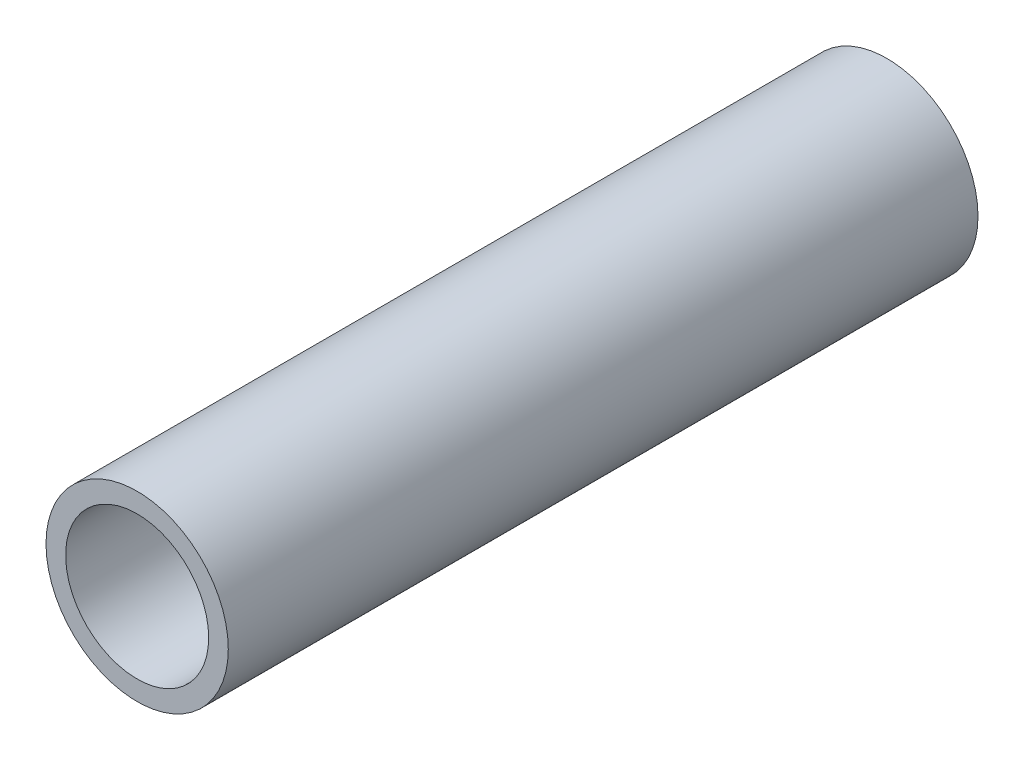
ISO-10303-21;
HEADER;
FILE_DESCRIPTION(('STEP AP214'),'2;1');
FILE_NAME('part.step','',(''),(''),'','','');
FILE_SCHEMA(('AUTOMOTIVE_DESIGN { 1 0 10303 214 1 1 1 1 }'));
ENDSEC;
DATA;
#1=APPLICATION_CONTEXT('core data for automotive mechanical design processes');
#2=APPLICATION_PROTOCOL_DEFINITION('international standard','automotive_design',2000,#1);
#3=PRODUCT_CONTEXT('',#1,'mechanical');
#4=PRODUCT('Part','Part','',(#3));
#5=PRODUCT_RELATED_PRODUCT_CATEGORY('part','',(#4));
#6=PRODUCT_DEFINITION_FORMATION('','',#4);
#7=PRODUCT_DEFINITION_CONTEXT('part definition',#1,'design');
#8=PRODUCT_DEFINITION('design','',#6,#7);
#9=PRODUCT_DEFINITION_SHAPE('','',#8);
#10=(LENGTH_UNIT() NAMED_UNIT(*) SI_UNIT(.MILLI.,.METRE.));
#11=(NAMED_UNIT(*) PLANE_ANGLE_UNIT() SI_UNIT($,.RADIAN.));
#12=(NAMED_UNIT(*) SI_UNIT($,.STERADIAN.) SOLID_ANGLE_UNIT());
#13=UNCERTAINTY_MEASURE_WITH_UNIT(LENGTH_MEASURE(1.E-05),#10,'distance_accuracy_value','');
#14=(GEOMETRIC_REPRESENTATION_CONTEXT(3) GLOBAL_UNCERTAINTY_ASSIGNED_CONTEXT((#13)) GLOBAL_UNIT_ASSIGNED_CONTEXT((#10,
#11,#12)) REPRESENTATION_CONTEXT('',''));
#15=CARTESIAN_POINT('',(0.,0.,0.));
#16=DIRECTION('',(0.,0.,1.));
#17=DIRECTION('',(1.,0.,0.));
#18=AXIS2_PLACEMENT_3D('',#15,#16,#17);
#19=CARTESIAN_POINT('',(0.,0.,762.));
#20=DIRECTION('',(0.,0.,-1.));
#21=DIRECTION('',(-1.,0.,0.));
#22=AXIS2_PLACEMENT_3D('',#19,#20,#21);
#23=CYLINDRICAL_SURFACE('',#22,13.335);
#24=CARTESIAN_POINT('',(0.,0.,-762.));
#25=DIRECTION('',(0.,0.,1.));
#26=DIRECTION('',(1.,0.,0.));
#27=AXIS2_PLACEMENT_3D('',#24,#25,#26);
#28=CIRCLE('',#27,13.335);
#29=CARTESIAN_POINT('',(13.335,0.,-762.));
#30=VERTEX_POINT('',#29);
#31=EDGE_CURVE('E11',#30,#30,#28,.T.);
#32=ORIENTED_EDGE('',*,*,#31,.T.);
#33=EDGE_LOOP('',(#32));
#34=FACE_BOUND('',#33,.T.);
#35=CARTESIAN_POINT('',(0.,0.,-652.311));
#36=DIRECTION('',(0.,0.,1.));
#37=DIRECTION('',(1.,0.,0.));
#38=AXIS2_PLACEMENT_3D('',#35,#36,#37);
#39=CIRCLE('',#38,13.335);
#40=CARTESIAN_POINT('',(13.335,0.,-652.311));
#41=VERTEX_POINT('',#40);
#42=EDGE_CURVE('E58',#41,#41,#39,.F.);
#43=ORIENTED_EDGE('',*,*,#42,.T.);
#44=EDGE_LOOP('',(#43));
#45=FACE_BOUND('',#44,.T.);
#46=ADVANCED_FACE('F43',(#34,#45),#23,.T.);
#47=CARTESIAN_POINT('',(0.,0.,762.));
#48=DIRECTION('',(0.,0.,-1.));
#49=DIRECTION('',(-1.,0.,0.));
#50=AXIS2_PLACEMENT_3D('',#47,#48,#49);
#51=CYLINDRICAL_SURFACE('',#50,10.4648);
#52=CARTESIAN_POINT('',(0.,0.,-762.));
#53=DIRECTION('',(0.,0.,1.));
#54=DIRECTION('',(1.,0.,0.));
#55=AXIS2_PLACEMENT_3D('',#52,#53,#54);
#56=CIRCLE('',#55,10.4648);
#57=CARTESIAN_POINT('',(10.4648,0.,-762.));
#58=VERTEX_POINT('',#57);
#59=EDGE_CURVE('E51',#58,#58,#56,.T.);
#60=ORIENTED_EDGE('',*,*,#59,.F.);
#61=EDGE_LOOP('',(#60));
#62=FACE_BOUND('',#61,.T.);
#63=CARTESIAN_POINT('',(0.,0.,-652.311));
#64=DIRECTION('',(0.,0.,1.));
#65=DIRECTION('',(1.,0.,0.));
#66=AXIS2_PLACEMENT_3D('',#63,#64,#65);
#67=CIRCLE('',#66,10.4648);
#68=CARTESIAN_POINT('',(10.4648,0.,-652.311));
#69=VERTEX_POINT('',#68);
#70=EDGE_CURVE('E46',#69,#69,#67,.T.);
#71=ORIENTED_EDGE('',*,*,#70,.T.);
#72=EDGE_LOOP('',(#71));
#73=FACE_BOUND('',#72,.T.);
#74=ADVANCED_FACE('F67',(#62,#73),#51,.F.);
#75=CARTESIAN_POINT('',(0.,0.,-762.));
#76=DIRECTION('',(0.,0.,1.));
#77=DIRECTION('',(1.,0.,0.));
#78=AXIS2_PLACEMENT_3D('',#75,#76,#77);
#79=PLANE('',#78);
#80=ORIENTED_EDGE('',*,*,#59,.T.);
#81=EDGE_LOOP('',(#80));
#82=FACE_BOUND('',#81,.T.);
#83=ORIENTED_EDGE('',*,*,#31,.F.);
#84=EDGE_LOOP('',(#83));
#85=FACE_BOUND('',#84,.T.);
#86=ADVANCED_FACE('F72',(#82,#85),#79,.F.);
#87=CARTESIAN_POINT('',(0.,0.,-652.311));
#88=DIRECTION('',(0.,0.,1.));
#89=DIRECTION('',(1.,0.,0.));
#90=AXIS2_PLACEMENT_3D('',#87,#88,#89);
#91=PLANE('',#90);
#92=ORIENTED_EDGE('',*,*,#70,.F.);
#93=EDGE_LOOP('',(#92));
#94=FACE_BOUND('',#93,.T.);
#95=ORIENTED_EDGE('',*,*,#42,.F.);
#96=EDGE_LOOP('',(#95));
#97=FACE_BOUND('',#96,.T.);
#98=ADVANCED_FACE('F69',(#94,#97),#91,.T.);
#99=CLOSED_SHELL('',(#46,#74,#86,#98));
#100=MANIFOLD_SOLID_BREP('B2',#99);
#101=ADVANCED_BREP_SHAPE_REPRESENTATION('',(#18,#100),#14);
#102=SHAPE_DEFINITION_REPRESENTATION(#9,#101);
ENDSEC;
END-ISO-10303-21;
